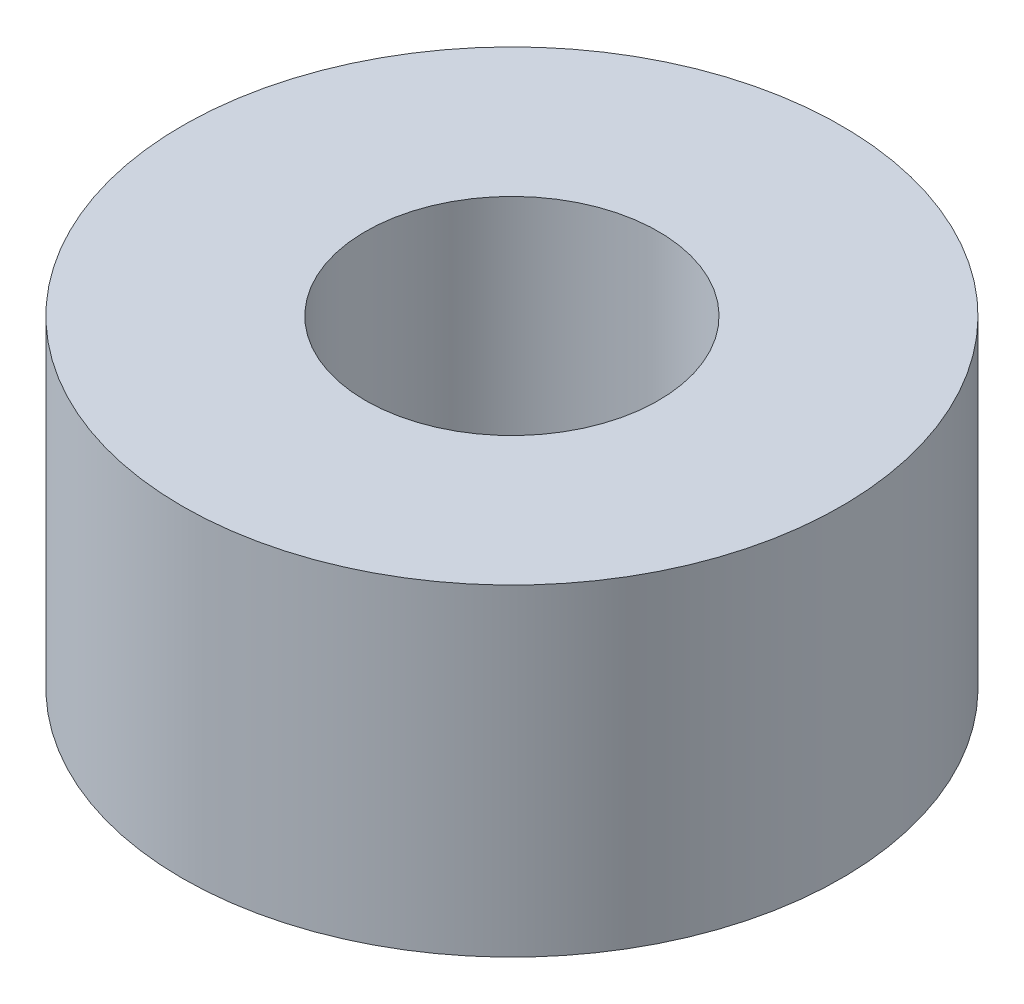
ISO-10303-21;
HEADER;
FILE_DESCRIPTION(('STEP AP214'),'2;1');
FILE_NAME('part.step','',(''),(''),'','','');
FILE_SCHEMA(('AUTOMOTIVE_DESIGN { 1 0 10303 214 1 1 1 1 }'));
ENDSEC;
DATA;
#1=APPLICATION_CONTEXT('core data for automotive mechanical design processes');
#2=APPLICATION_PROTOCOL_DEFINITION('international standard','automotive_design',2000,#1);
#3=PRODUCT_CONTEXT('',#1,'mechanical');
#4=PRODUCT('Part','Part','',(#3));
#5=PRODUCT_RELATED_PRODUCT_CATEGORY('part','',(#4));
#6=PRODUCT_DEFINITION_FORMATION('','',#4);
#7=PRODUCT_DEFINITION_CONTEXT('part definition',#1,'design');
#8=PRODUCT_DEFINITION('design','',#6,#7);
#9=PRODUCT_DEFINITION_SHAPE('','',#8);
#10=(LENGTH_UNIT() NAMED_UNIT(*) SI_UNIT(.MILLI.,.METRE.));
#11=(NAMED_UNIT(*) PLANE_ANGLE_UNIT() SI_UNIT($,.RADIAN.));
#12=(NAMED_UNIT(*) SI_UNIT($,.STERADIAN.) SOLID_ANGLE_UNIT());
#13=UNCERTAINTY_MEASURE_WITH_UNIT(LENGTH_MEASURE(1.E-05),#10,'distance_accuracy_value','');
#14=(GEOMETRIC_REPRESENTATION_CONTEXT(3) GLOBAL_UNCERTAINTY_ASSIGNED_CONTEXT((#13)) GLOBAL_UNIT_ASSIGNED_CONTEXT((#10,
#11,#12)) REPRESENTATION_CONTEXT('',''));
#15=CARTESIAN_POINT('',(0.,0.,0.));
#16=DIRECTION('',(0.,0.,1.));
#17=DIRECTION('',(1.,0.,0.));
#18=AXIS2_PLACEMENT_3D('',#15,#16,#17);
#19=CARTESIAN_POINT('',(0.,5.588,0.));
#20=DIRECTION('',(0.,1.,0.));
#21=DIRECTION('',(0.,0.,1.));
#22=AXIS2_PLACEMENT_3D('',#19,#20,#21);
#23=PLANE('',#22);
#24=CARTESIAN_POINT('',(0.,5.588,0.));
#25=DIRECTION('',(0.,1.,0.));
#26=DIRECTION('',(0.,0.,1.));
#27=AXIS2_PLACEMENT_3D('',#24,#25,#26);
#28=CIRCLE('',#27,5.715);
#29=CARTESIAN_POINT('',(0.,5.588,5.715));
#30=VERTEX_POINT('',#29);
#31=EDGE_CURVE('E10',#30,#30,#28,.T.);
#32=ORIENTED_EDGE('',*,*,#31,.T.);
#33=EDGE_LOOP('',(#32));
#34=FACE_BOUND('',#33,.T.);
#35=CARTESIAN_POINT('',(0.,5.588,0.));
#36=DIRECTION('',(0.,1.,0.));
#37=DIRECTION('',(0.,0.,1.));
#38=AXIS2_PLACEMENT_3D('',#35,#36,#37);
#39=CIRCLE('',#38,2.54);
#40=CARTESIAN_POINT('',(0.,5.588,2.54));
#41=VERTEX_POINT('',#40);
#42=EDGE_CURVE('E50',#41,#41,#39,.T.);
#43=ORIENTED_EDGE('',*,*,#42,.F.);
#44=EDGE_LOOP('',(#43));
#45=FACE_BOUND('',#44,.T.);
#46=ADVANCED_FACE('F37',(#34,#45),#23,.T.);
#47=CARTESIAN_POINT('',(0.,0.,0.));
#48=DIRECTION('',(0.,1.,0.));
#49=DIRECTION('',(0.,0.,1.));
#50=AXIS2_PLACEMENT_3D('',#47,#48,#49);
#51=PLANE('',#50);
#52=CARTESIAN_POINT('',(0.,0.,0.));
#53=DIRECTION('',(0.,1.,0.));
#54=DIRECTION('',(0.,0.,1.));
#55=AXIS2_PLACEMENT_3D('',#52,#53,#54);
#56=CIRCLE('',#55,5.715);
#57=CARTESIAN_POINT('',(0.,0.,5.715));
#58=VERTEX_POINT('',#57);
#59=EDGE_CURVE('E41',#58,#58,#56,.T.);
#60=ORIENTED_EDGE('',*,*,#59,.F.);
#61=EDGE_LOOP('',(#60));
#62=FACE_BOUND('',#61,.T.);
#63=CARTESIAN_POINT('',(0.,0.,0.));
#64=DIRECTION('',(0.,1.,0.));
#65=DIRECTION('',(0.,0.,1.));
#66=AXIS2_PLACEMENT_3D('',#63,#64,#65);
#67=CIRCLE('',#66,2.54);
#68=CARTESIAN_POINT('',(0.,0.,2.54));
#69=VERTEX_POINT('',#68);
#70=EDGE_CURVE('E52',#69,#69,#67,.T.);
#71=ORIENTED_EDGE('',*,*,#70,.T.);
#72=EDGE_LOOP('',(#71));
#73=FACE_BOUND('',#72,.T.);
#74=ADVANCED_FACE('F64',(#62,#73),#51,.F.);
#75=CARTESIAN_POINT('',(0.,5.588,0.));
#76=DIRECTION('',(0.,-1.,0.));
#77=DIRECTION('',(0.,0.,-1.));
#78=AXIS2_PLACEMENT_3D('',#75,#76,#77);
#79=CYLINDRICAL_SURFACE('',#78,5.715);
#80=ORIENTED_EDGE('',*,*,#31,.F.);
#81=EDGE_LOOP('',(#80));
#82=FACE_BOUND('',#81,.T.);
#83=ORIENTED_EDGE('',*,*,#59,.T.);
#84=EDGE_LOOP('',(#83));
#85=FACE_BOUND('',#84,.T.);
#86=ADVANCED_FACE('F39',(#82,#85),#79,.T.);
#87=CARTESIAN_POINT('',(0.,5.588,0.));
#88=DIRECTION('',(0.,-1.,0.));
#89=DIRECTION('',(0.,0.,-1.));
#90=AXIS2_PLACEMENT_3D('',#87,#88,#89);
#91=CYLINDRICAL_SURFACE('',#90,2.54);
#92=ORIENTED_EDGE('',*,*,#42,.T.);
#93=EDGE_LOOP('',(#92));
#94=FACE_BOUND('',#93,.T.);
#95=ORIENTED_EDGE('',*,*,#70,.F.);
#96=EDGE_LOOP('',(#95));
#97=FACE_BOUND('',#96,.T.);
#98=ADVANCED_FACE('F60',(#94,#97),#91,.F.);
#99=CLOSED_SHELL('',(#46,#74,#86,#98));
#100=MANIFOLD_SOLID_BREP('B2',#99);
#101=ADVANCED_BREP_SHAPE_REPRESENTATION('',(#18,#100),#14);
#102=SHAPE_DEFINITION_REPRESENTATION(#9,#101);
ENDSEC;
END-ISO-10303-21;
